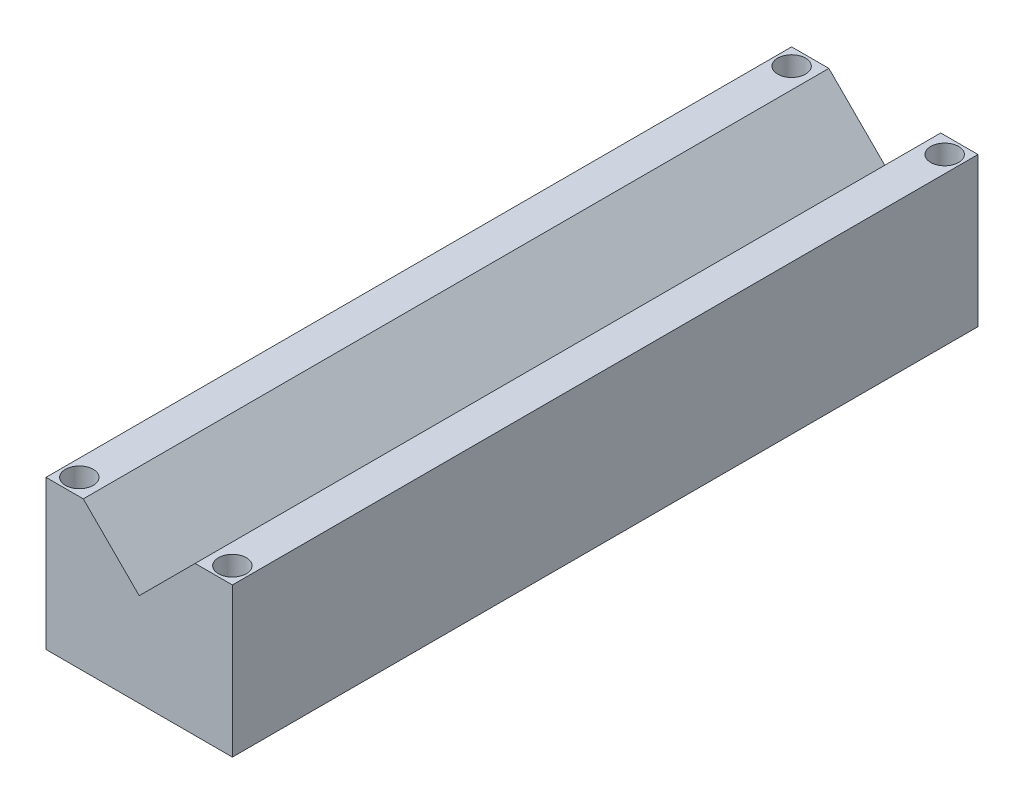
ISO-10303-21;
HEADER;
FILE_DESCRIPTION(('STEP AP214'),'2;1');
FILE_NAME('part.step','',(''),(''),'','','');
FILE_SCHEMA(('AUTOMOTIVE_DESIGN { 1 0 10303 214 1 1 1 1 }'));
ENDSEC;
DATA;
#1=APPLICATION_CONTEXT('core data for automotive mechanical design processes');
#2=APPLICATION_PROTOCOL_DEFINITION('international standard','automotive_design',2000,#1);
#3=PRODUCT_CONTEXT('',#1,'mechanical');
#4=PRODUCT('Part','Part','',(#3));
#5=PRODUCT_RELATED_PRODUCT_CATEGORY('part','',(#4));
#6=PRODUCT_DEFINITION_FORMATION('','',#4);
#7=PRODUCT_DEFINITION_CONTEXT('part definition',#1,'design');
#8=PRODUCT_DEFINITION('design','',#6,#7);
#9=PRODUCT_DEFINITION_SHAPE('','',#8);
#10=(LENGTH_UNIT() NAMED_UNIT(*) SI_UNIT(.MILLI.,.METRE.));
#11=(NAMED_UNIT(*) PLANE_ANGLE_UNIT() SI_UNIT($,.RADIAN.));
#12=(NAMED_UNIT(*) SI_UNIT($,.STERADIAN.) SOLID_ANGLE_UNIT());
#13=UNCERTAINTY_MEASURE_WITH_UNIT(LENGTH_MEASURE(1.E-05),#10,'distance_accuracy_value','');
#14=(GEOMETRIC_REPRESENTATION_CONTEXT(3) GLOBAL_UNCERTAINTY_ASSIGNED_CONTEXT((#13)) GLOBAL_UNIT_ASSIGNED_CONTEXT((#10,
#11,#12)) REPRESENTATION_CONTEXT('',''));
#15=CARTESIAN_POINT('',(0.,0.,0.));
#16=DIRECTION('',(0.,0.,1.));
#17=DIRECTION('',(1.,0.,0.));
#18=AXIS2_PLACEMENT_3D('',#15,#16,#17);
#19=CARTESIAN_POINT('',(5.68,-8.98025612106916,-248.325));
#20=DIRECTION('',(0.,1.,0.));
#21=DIRECTION('',(0.,0.,1.));
#22=AXIS2_PLACEMENT_3D('',#19,#20,#21);
#23=CYLINDRICAL_SURFACE('',#22,3.175);
#24=CARTESIAN_POINT('',(5.68,0.,-248.325));
#25=DIRECTION('',(0.,-1.,0.));
#26=DIRECTION('',(0.,0.,-1.));
#27=AXIS2_PLACEMENT_3D('',#24,#25,#26);
#28=CIRCLE('',#27,3.175);
#29=CARTESIAN_POINT('',(5.68,0.,-251.5));
#30=VERTEX_POINT('',#29);
#31=EDGE_CURVE('E195',#30,#30,#28,.F.);
#32=ORIENTED_EDGE('',*,*,#31,.F.);
#33=EDGE_LOOP('',(#32));
#34=FACE_BOUND('',#33,.T.);
#35=CARTESIAN_POINT('',(5.68,42.8,-248.325));
#36=DIRECTION('',(0.,1.,0.));
#37=DIRECTION('',(0.,0.,1.));
#38=AXIS2_PLACEMENT_3D('',#35,#36,#37);
#39=CIRCLE('',#38,3.175);
#40=CARTESIAN_POINT('',(5.68,42.8,-245.15));
#41=VERTEX_POINT('',#40);
#42=EDGE_CURVE('E41',#41,#41,#39,.F.);
#43=ORIENTED_EDGE('',*,*,#42,.F.);
#44=EDGE_LOOP('',(#43));
#45=FACE_BOUND('',#44,.T.);
#46=ADVANCED_FACE('F37',(#34,#45),#23,.F.);
#47=CARTESIAN_POINT('',(57.82,-8.98025612106916,-248.325));
#48=DIRECTION('',(0.,1.,0.));
#49=DIRECTION('',(0.,0.,1.));
#50=AXIS2_PLACEMENT_3D('',#47,#48,#49);
#51=CYLINDRICAL_SURFACE('',#50,3.175);
#52=CARTESIAN_POINT('',(57.82,0.,-248.325));
#53=DIRECTION('',(0.,-1.,0.));
#54=DIRECTION('',(0.,0.,-1.));
#55=AXIS2_PLACEMENT_3D('',#52,#53,#54);
#56=CIRCLE('',#55,3.175);
#57=CARTESIAN_POINT('',(57.82,0.,-251.5));
#58=VERTEX_POINT('',#57);
#59=EDGE_CURVE('E154',#58,#58,#56,.F.);
#60=ORIENTED_EDGE('',*,*,#59,.F.);
#61=EDGE_LOOP('',(#60));
#62=FACE_BOUND('',#61,.T.);
#63=CARTESIAN_POINT('',(57.82,42.8,-248.325));
#64=DIRECTION('',(0.,1.,0.));
#65=DIRECTION('',(0.,0.,1.));
#66=AXIS2_PLACEMENT_3D('',#63,#64,#65);
#67=CIRCLE('',#66,3.175);
#68=CARTESIAN_POINT('',(57.82,42.8,-245.15));
#69=VERTEX_POINT('',#68);
#70=EDGE_CURVE('E160',#69,#69,#67,.F.);
#71=ORIENTED_EDGE('',*,*,#70,.F.);
#72=EDGE_LOOP('',(#71));
#73=FACE_BOUND('',#72,.T.);
#74=ADVANCED_FACE('F234',(#62,#73),#51,.F.);
#75=CARTESIAN_POINT('',(0.,50.8,-254.));
#76=DIRECTION('',(0.,1.,0.));
#77=DIRECTION('',(0.,0.,1.));
#78=AXIS2_PLACEMENT_3D('',#75,#76,#77);
#79=PLANE('',#78);
#80=CARTESIAN_POINT('',(57.82,50.8,-248.325));
#81=DIRECTION('',(0.,1.,0.));
#82=DIRECTION('',(0.,0.,1.));
#83=AXIS2_PLACEMENT_3D('',#80,#81,#82);
#84=CIRCLE('',#83,4.75);
#85=CARTESIAN_POINT('',(57.82,50.8,-243.575));
#86=VERTEX_POINT('',#85);
#87=EDGE_CURVE('E168',#86,#86,#84,.T.);
#88=ORIENTED_EDGE('',*,*,#87,.F.);
#89=EDGE_LOOP('',(#88));
#90=FACE_BOUND('',#89,.T.);
#91=DIRECTION('',(0.,0.,1.));
#92=VECTOR('',#91,1.);
#93=CARTESIAN_POINT('',(50.7999999999998,50.8,-296.597094971371));
#94=LINE('',#93,#92);
#95=CARTESIAN_POINT('',(50.7999999999998,50.8,-254.));
#96=VERTEX_POINT('',#95);
#97=CARTESIAN_POINT('',(50.7999999999998,50.8,0.));
#98=VERTEX_POINT('',#97);
#99=EDGE_CURVE('E107',#96,#98,#94,.T.);
#100=ORIENTED_EDGE('',*,*,#99,.T.);
#101=DIRECTION('',(-1.,0.,0.));
#102=VECTOR('',#101,1.);
#103=CARTESIAN_POINT('',(0.,50.8,0.));
#104=LINE('',#103,#102);
#105=CARTESIAN_POINT('',(63.5,50.8,0.));
#106=VERTEX_POINT('',#105);
#107=EDGE_CURVE('E146',#106,#98,#104,.T.);
#108=ORIENTED_EDGE('',*,*,#107,.F.);
#109=DIRECTION('',(0.,0.,1.));
#110=VECTOR('',#109,1.);
#111=CARTESIAN_POINT('',(63.5,50.8,-254.));
#112=LINE('',#111,#110);
#113=CARTESIAN_POINT('',(63.5,50.8,-254.));
#114=VERTEX_POINT('',#113);
#115=EDGE_CURVE('E46',#114,#106,#112,.T.);
#116=ORIENTED_EDGE('',*,*,#115,.F.);
#117=DIRECTION('',(-1.,0.,0.));
#118=VECTOR('',#117,1.);
#119=CARTESIAN_POINT('',(0.,50.8,-254.));
#120=LINE('',#119,#118);
#121=EDGE_CURVE('E124',#114,#96,#120,.T.);
#122=ORIENTED_EDGE('',*,*,#121,.T.);
#123=EDGE_LOOP('',(#100,#108,#116,#122));
#124=FACE_BOUND('',#123,.T.);
#125=CARTESIAN_POINT('',(57.82,50.8,-5.675));
#126=DIRECTION('',(0.,1.,0.));
#127=DIRECTION('',(0.,0.,1.));
#128=AXIS2_PLACEMENT_3D('',#125,#126,#127);
#129=CIRCLE('',#128,4.75);
#130=CARTESIAN_POINT('',(57.82,50.8,-0.925000000000001));
#131=VERTEX_POINT('',#130);
#132=EDGE_CURVE('E158',#131,#131,#129,.T.);
#133=ORIENTED_EDGE('',*,*,#132,.F.);
#134=EDGE_LOOP('',(#133));
#135=FACE_BOUND('',#134,.T.);
#136=ADVANCED_FACE('F127',(#90,#124,#135),#79,.T.);
#137=CARTESIAN_POINT('',(5.68,-8.98025612106916,-5.675));
#138=DIRECTION('',(0.,1.,0.));
#139=DIRECTION('',(0.,0.,1.));
#140=AXIS2_PLACEMENT_3D('',#137,#138,#139);
#141=CYLINDRICAL_SURFACE('',#140,3.175);
#142=CARTESIAN_POINT('',(5.68,0.,-5.675));
#143=DIRECTION('',(0.,-1.,0.));
#144=DIRECTION('',(0.,0.,-1.));
#145=AXIS2_PLACEMENT_3D('',#142,#143,#144);
#146=CIRCLE('',#145,3.175);
#147=CARTESIAN_POINT('',(5.68,0.,-8.85));
#148=VERTEX_POINT('',#147);
#149=EDGE_CURVE('E192',#148,#148,#146,.F.);
#150=ORIENTED_EDGE('',*,*,#149,.F.);
#151=EDGE_LOOP('',(#150));
#152=FACE_BOUND('',#151,.T.);
#153=CARTESIAN_POINT('',(5.68,42.8,-5.675));
#154=DIRECTION('',(0.,1.,0.));
#155=DIRECTION('',(0.,0.,1.));
#156=AXIS2_PLACEMENT_3D('',#153,#154,#155);
#157=CIRCLE('',#156,3.175);
#158=CARTESIAN_POINT('',(5.68,42.8,-2.5));
#159=VERTEX_POINT('',#158);
#160=EDGE_CURVE('E156',#159,#159,#157,.F.);
#161=ORIENTED_EDGE('',*,*,#160,.F.);
#162=EDGE_LOOP('',(#161));
#163=FACE_BOUND('',#162,.T.);
#164=ADVANCED_FACE('F245',(#152,#163),#141,.F.);
#165=CARTESIAN_POINT('',(57.82,-8.98025612106916,-5.675));
#166=DIRECTION('',(0.,1.,0.));
#167=DIRECTION('',(0.,0.,1.));
#168=AXIS2_PLACEMENT_3D('',#165,#166,#167);
#169=CYLINDRICAL_SURFACE('',#168,3.175);
#170=CARTESIAN_POINT('',(57.82,0.,-5.675));
#171=DIRECTION('',(0.,-1.,0.));
#172=DIRECTION('',(0.,0.,-1.));
#173=AXIS2_PLACEMENT_3D('',#170,#171,#172);
#174=CIRCLE('',#173,3.175);
#175=CARTESIAN_POINT('',(57.82,0.,-8.85));
#176=VERTEX_POINT('',#175);
#177=EDGE_CURVE('E140',#176,#176,#174,.F.);
#178=ORIENTED_EDGE('',*,*,#177,.F.);
#179=EDGE_LOOP('',(#178));
#180=FACE_BOUND('',#179,.T.);
#181=CARTESIAN_POINT('',(57.82,42.8,-5.675));
#182=DIRECTION('',(0.,1.,0.));
#183=DIRECTION('',(0.,0.,1.));
#184=AXIS2_PLACEMENT_3D('',#181,#182,#183);
#185=CIRCLE('',#184,3.175);
#186=CARTESIAN_POINT('',(57.82,42.8,-2.5));
#187=VERTEX_POINT('',#186);
#188=EDGE_CURVE('E151',#187,#187,#185,.F.);
#189=ORIENTED_EDGE('',*,*,#188,.F.);
#190=EDGE_LOOP('',(#189));
#191=FACE_BOUND('',#190,.T.);
#192=ADVANCED_FACE('F248',(#180,#191),#169,.F.);
#193=CARTESIAN_POINT('',(0.,0.,-254.));
#194=DIRECTION('',(-1.,0.,0.));
#195=DIRECTION('',(0.,0.,1.));
#196=AXIS2_PLACEMENT_3D('',#193,#194,#195);
#197=PLANE('',#196);
#198=DIRECTION('',(0.,-1.,0.));
#199=VECTOR('',#198,1.);
#200=CARTESIAN_POINT('',(0.,0.,0.));
#201=LINE('',#200,#199);
#202=CARTESIAN_POINT('',(0.,50.8,0.));
#203=VERTEX_POINT('',#202);
#204=CARTESIAN_POINT('',(0.,0.,0.));
#205=VERTEX_POINT('',#204);
#206=EDGE_CURVE('E137',#203,#205,#201,.T.);
#207=ORIENTED_EDGE('',*,*,#206,.F.);
#208=DIRECTION('',(0.,0.,1.));
#209=VECTOR('',#208,1.);
#210=CARTESIAN_POINT('',(0.,50.8,-254.));
#211=LINE('',#210,#209);
#212=CARTESIAN_POINT('',(0.,50.8,-254.));
#213=VERTEX_POINT('',#212);
#214=EDGE_CURVE('E11',#213,#203,#211,.T.);
#215=ORIENTED_EDGE('',*,*,#214,.F.);
#216=DIRECTION('',(0.,-1.,0.));
#217=VECTOR('',#216,1.);
#218=CARTESIAN_POINT('',(0.,0.,-254.));
#219=LINE('',#218,#217);
#220=CARTESIAN_POINT('',(0.,0.,-254.));
#221=VERTEX_POINT('',#220);
#222=EDGE_CURVE('E147',#213,#221,#219,.T.);
#223=ORIENTED_EDGE('',*,*,#222,.T.);
#224=DIRECTION('',(0.,0.,1.));
#225=VECTOR('',#224,1.);
#226=CARTESIAN_POINT('',(0.,0.,-254.));
#227=LINE('',#226,#225);
#228=EDGE_CURVE('E89',#221,#205,#227,.T.);
#229=ORIENTED_EDGE('',*,*,#228,.T.);
#230=EDGE_LOOP('',(#207,#215,#223,#229));
#231=FACE_BOUND('',#230,.T.);
#232=ADVANCED_FACE('F39',(#231),#197,.T.);
#233=CARTESIAN_POINT('',(5.68,50.8,-248.325));
#234=DIRECTION('',(0.,1.,0.));
#235=DIRECTION('',(0.,0.,1.));
#236=AXIS2_PLACEMENT_3D('',#233,#234,#235);
#237=CIRCLE('',#236,4.75);
#238=CARTESIAN_POINT('',(5.68,50.8,-243.575));
#239=VERTEX_POINT('',#238);
#240=EDGE_CURVE('E175',#239,#239,#237,.T.);
#241=ORIENTED_EDGE('',*,*,#240,.F.);
#242=EDGE_LOOP('',(#241));
#243=FACE_BOUND('',#242,.T.);
#244=DIRECTION('',(0.,0.,1.));
#245=VECTOR('',#244,1.);
#246=CARTESIAN_POINT('',(12.7000000000002,50.8,-296.597094971371));
#247=LINE('',#246,#245);
#248=CARTESIAN_POINT('',(12.7000000000002,50.8,-254.));
#249=VERTEX_POINT('',#248);
#250=CARTESIAN_POINT('',(12.7000000000002,50.8,0.));
#251=VERTEX_POINT('',#250);
#252=EDGE_CURVE('E54',#249,#251,#247,.T.);
#253=ORIENTED_EDGE('',*,*,#252,.F.);
#254=EDGE_CURVE('E61',#249,#213,#120,.T.);
#255=ORIENTED_EDGE('',*,*,#254,.T.);
#256=ORIENTED_EDGE('',*,*,#214,.T.);
#257=EDGE_CURVE('E83',#251,#203,#104,.T.);
#258=ORIENTED_EDGE('',*,*,#257,.F.);
#259=EDGE_LOOP('',(#253,#255,#256,#258));
#260=FACE_BOUND('',#259,.T.);
#261=CARTESIAN_POINT('',(5.68,50.8,-5.675));
#262=DIRECTION('',(0.,1.,0.));
#263=DIRECTION('',(0.,0.,1.));
#264=AXIS2_PLACEMENT_3D('',#261,#262,#263);
#265=CIRCLE('',#264,4.75);
#266=CARTESIAN_POINT('',(5.68,50.8,-0.924999999999999));
#267=VERTEX_POINT('',#266);
#268=EDGE_CURVE('E183',#267,#267,#265,.T.);
#269=ORIENTED_EDGE('',*,*,#268,.F.);
#270=EDGE_LOOP('',(#269));
#271=FACE_BOUND('',#270,.T.);
#272=ADVANCED_FACE('F210',(#243,#260,#271),#79,.T.);
#273=CARTESIAN_POINT('',(63.5,0.,-254.));
#274=DIRECTION('',(1.,0.,0.));
#275=DIRECTION('',(0.,0.,-1.));
#276=AXIS2_PLACEMENT_3D('',#273,#274,#275);
#277=PLANE('',#276);
#278=DIRECTION('',(0.,1.,0.));
#279=VECTOR('',#278,1.);
#280=CARTESIAN_POINT('',(63.5,0.,0.));
#281=LINE('',#280,#279);
#282=CARTESIAN_POINT('',(63.5,0.,0.));
#283=VERTEX_POINT('',#282);
#284=EDGE_CURVE('E143',#283,#106,#281,.T.);
#285=ORIENTED_EDGE('',*,*,#284,.F.);
#286=DIRECTION('',(0.,0.,1.));
#287=VECTOR('',#286,1.);
#288=CARTESIAN_POINT('',(63.5,0.,-254.));
#289=LINE('',#288,#287);
#290=CARTESIAN_POINT('',(63.5,0.,-254.));
#291=VERTEX_POINT('',#290);
#292=EDGE_CURVE('E131',#291,#283,#289,.T.);
#293=ORIENTED_EDGE('',*,*,#292,.F.);
#294=DIRECTION('',(0.,1.,0.));
#295=VECTOR('',#294,1.);
#296=CARTESIAN_POINT('',(63.5,0.,-254.));
#297=LINE('',#296,#295);
#298=EDGE_CURVE('E133',#291,#114,#297,.T.);
#299=ORIENTED_EDGE('',*,*,#298,.T.);
#300=ORIENTED_EDGE('',*,*,#115,.T.);
#301=EDGE_LOOP('',(#285,#293,#299,#300));
#302=FACE_BOUND('',#301,.T.);
#303=ADVANCED_FACE('F206',(#302),#277,.T.);
#304=CARTESIAN_POINT('',(0.,0.,-254.));
#305=DIRECTION('',(0.,-1.,0.));
#306=DIRECTION('',(0.,0.,-1.));
#307=AXIS2_PLACEMENT_3D('',#304,#305,#306);
#308=PLANE('',#307);
#309=ORIENTED_EDGE('',*,*,#149,.T.);
#310=EDGE_LOOP('',(#309));
#311=FACE_BOUND('',#310,.T.);
#312=ORIENTED_EDGE('',*,*,#31,.T.);
#313=EDGE_LOOP('',(#312));
#314=FACE_BOUND('',#313,.T.);
#315=ORIENTED_EDGE('',*,*,#59,.T.);
#316=EDGE_LOOP('',(#315));
#317=FACE_BOUND('',#316,.T.);
#318=ORIENTED_EDGE('',*,*,#177,.T.);
#319=EDGE_LOOP('',(#318));
#320=FACE_BOUND('',#319,.T.);
#321=DIRECTION('',(1.,0.,0.));
#322=VECTOR('',#321,1.);
#323=CARTESIAN_POINT('',(0.,0.,0.));
#324=LINE('',#323,#322);
#325=EDGE_CURVE('E139',#205,#283,#324,.T.);
#326=ORIENTED_EDGE('',*,*,#325,.F.);
#327=ORIENTED_EDGE('',*,*,#228,.F.);
#328=DIRECTION('',(1.,0.,0.));
#329=VECTOR('',#328,1.);
#330=CARTESIAN_POINT('',(0.,0.,-254.));
#331=LINE('',#330,#329);
#332=EDGE_CURVE('E203',#221,#291,#331,.T.);
#333=ORIENTED_EDGE('',*,*,#332,.T.);
#334=ORIENTED_EDGE('',*,*,#292,.T.);
#335=EDGE_LOOP('',(#326,#327,#333,#334));
#336=FACE_BOUND('',#335,.T.);
#337=ADVANCED_FACE('F255',(#311,#314,#317,#320,#336),#308,.T.);
#338=CARTESIAN_POINT('',(0.,0.,-254.));
#339=DIRECTION('',(0.,0.,-1.));
#340=DIRECTION('',(-1.,0.,0.));
#341=AXIS2_PLACEMENT_3D('',#338,#339,#340);
#342=PLANE('',#341);
#343=DIRECTION('',(0.707106781186543,0.707106781186552,0.));
#344=VECTOR('',#343,1.);
#345=CARTESIAN_POINT('',(31.75,31.75,-254.));
#346=LINE('',#345,#344);
#347=CARTESIAN_POINT('',(31.75,31.75,-254.));
#348=VERTEX_POINT('',#347);
#349=EDGE_CURVE('E110',#348,#96,#346,.T.);
#350=ORIENTED_EDGE('',*,*,#349,.T.);
#351=ORIENTED_EDGE('',*,*,#121,.F.);
#352=ORIENTED_EDGE('',*,*,#298,.F.);
#353=ORIENTED_EDGE('',*,*,#332,.F.);
#354=ORIENTED_EDGE('',*,*,#222,.F.);
#355=ORIENTED_EDGE('',*,*,#254,.F.);
#356=DIRECTION('',(0.707106781186544,-0.707106781186551,0.));
#357=VECTOR('',#356,1.);
#358=CARTESIAN_POINT('',(31.75,31.75,-254.));
#359=LINE('',#358,#357);
#360=EDGE_CURVE('E125',#249,#348,#359,.T.);
#361=ORIENTED_EDGE('',*,*,#360,.T.);
#362=EDGE_LOOP('',(#350,#351,#352,#353,#354,#355,#361));
#363=FACE_BOUND('',#362,.T.);
#364=ADVANCED_FACE('F122',(#363),#342,.T.);
#365=CARTESIAN_POINT('',(0.,0.,0.));
#366=DIRECTION('',(0.,0.,-1.));
#367=DIRECTION('',(-1.,0.,0.));
#368=AXIS2_PLACEMENT_3D('',#365,#366,#367);
#369=PLANE('',#368);
#370=ORIENTED_EDGE('',*,*,#107,.T.);
#371=DIRECTION('',(0.707106781186543,0.707106781186552,0.));
#372=VECTOR('',#371,1.);
#373=CARTESIAN_POINT('',(31.75,31.75,0.));
#374=LINE('',#373,#372);
#375=CARTESIAN_POINT('',(31.75,31.75,0.));
#376=VERTEX_POINT('',#375);
#377=EDGE_CURVE('E113',#376,#98,#374,.T.);
#378=ORIENTED_EDGE('',*,*,#377,.F.);
#379=DIRECTION('',(0.707106781186544,-0.707106781186552,0.));
#380=VECTOR('',#379,1.);
#381=CARTESIAN_POINT('',(31.75,31.75,0.));
#382=LINE('',#381,#380);
#383=EDGE_CURVE('E162',#251,#376,#382,.T.);
#384=ORIENTED_EDGE('',*,*,#383,.F.);
#385=ORIENTED_EDGE('',*,*,#257,.T.);
#386=ORIENTED_EDGE('',*,*,#206,.T.);
#387=ORIENTED_EDGE('',*,*,#325,.T.);
#388=ORIENTED_EDGE('',*,*,#284,.T.);
#389=EDGE_LOOP('',(#370,#378,#384,#385,#386,#387,#388));
#390=FACE_BOUND('',#389,.T.);
#391=ADVANCED_FACE('F254',(#390),#369,.F.);
#392=CARTESIAN_POINT('',(57.82,42.8,-5.675));
#393=DIRECTION('',(0.,1.,0.));
#394=DIRECTION('',(0.,0.,1.));
#395=AXIS2_PLACEMENT_3D('',#392,#393,#394);
#396=PLANE('',#395);
#397=CARTESIAN_POINT('',(57.82,42.8,-5.675));
#398=DIRECTION('',(0.,1.,0.));
#399=DIRECTION('',(0.,0.,1.));
#400=AXIS2_PLACEMENT_3D('',#397,#398,#399);
#401=CIRCLE('',#400,4.75);
#402=CARTESIAN_POINT('',(57.82,42.8,-0.925000000000001));
#403=VERTEX_POINT('',#402);
#404=EDGE_CURVE('E155',#403,#403,#401,.T.);
#405=ORIENTED_EDGE('',*,*,#404,.T.);
#406=EDGE_LOOP('',(#405));
#407=FACE_BOUND('',#406,.T.);
#408=ORIENTED_EDGE('',*,*,#188,.T.);
#409=EDGE_LOOP('',(#408));
#410=FACE_BOUND('',#409,.T.);
#411=ADVANCED_FACE('F257',(#407,#410),#396,.T.);
#412=CARTESIAN_POINT('',(57.82,42.8,-5.675));
#413=DIRECTION('',(0.,1.,0.));
#414=DIRECTION('',(0.,0.,1.));
#415=AXIS2_PLACEMENT_3D('',#412,#413,#414);
#416=CYLINDRICAL_SURFACE('',#415,4.75);
#417=ORIENTED_EDGE('',*,*,#404,.F.);
#418=EDGE_LOOP('',(#417));
#419=FACE_BOUND('',#418,.T.);
#420=ORIENTED_EDGE('',*,*,#132,.T.);
#421=EDGE_LOOP('',(#420));
#422=FACE_BOUND('',#421,.T.);
#423=ADVANCED_FACE('F228',(#419,#422),#416,.F.);
#424=CARTESIAN_POINT('',(5.68,42.8,-5.675));
#425=DIRECTION('',(0.,1.,0.));
#426=DIRECTION('',(0.,0.,1.));
#427=AXIS2_PLACEMENT_3D('',#424,#425,#426);
#428=PLANE('',#427);
#429=CARTESIAN_POINT('',(5.68,42.8,-5.675));
#430=DIRECTION('',(0.,1.,0.));
#431=DIRECTION('',(0.,0.,1.));
#432=AXIS2_PLACEMENT_3D('',#429,#430,#431);
#433=CIRCLE('',#432,4.75);
#434=CARTESIAN_POINT('',(5.68,42.8,-0.924999999999999));
#435=VERTEX_POINT('',#434);
#436=EDGE_CURVE('E159',#435,#435,#433,.T.);
#437=ORIENTED_EDGE('',*,*,#436,.T.);
#438=EDGE_LOOP('',(#437));
#439=FACE_BOUND('',#438,.T.);
#440=ORIENTED_EDGE('',*,*,#160,.T.);
#441=EDGE_LOOP('',(#440));
#442=FACE_BOUND('',#441,.T.);
#443=ADVANCED_FACE('F219',(#439,#442),#428,.T.);
#444=CARTESIAN_POINT('',(5.68,42.8,-5.675));
#445=DIRECTION('',(0.,1.,0.));
#446=DIRECTION('',(0.,0.,1.));
#447=AXIS2_PLACEMENT_3D('',#444,#445,#446);
#448=CYLINDRICAL_SURFACE('',#447,4.75);
#449=ORIENTED_EDGE('',*,*,#436,.F.);
#450=EDGE_LOOP('',(#449));
#451=FACE_BOUND('',#450,.T.);
#452=ORIENTED_EDGE('',*,*,#268,.T.);
#453=EDGE_LOOP('',(#452));
#454=FACE_BOUND('',#453,.T.);
#455=ADVANCED_FACE('F217',(#451,#454),#448,.F.);
#456=CARTESIAN_POINT('',(31.75,31.75,-296.597094971371));
#457=DIRECTION('',(0.707106781186552,-0.707106781186543,0.));
#458=DIRECTION('',(0.707106781186543,0.707106781186552,0.));
#459=AXIS2_PLACEMENT_3D('',#456,#457,#458);
#460=PLANE('',#459);
#461=DIRECTION('',(0.,0.,1.));
#462=VECTOR('',#461,1.);
#463=CARTESIAN_POINT('',(31.75,31.75,-296.597094971371));
#464=LINE('',#463,#462);
#465=EDGE_CURVE('E180',#348,#376,#464,.T.);
#466=ORIENTED_EDGE('',*,*,#465,.T.);
#467=ORIENTED_EDGE('',*,*,#377,.T.);
#468=ORIENTED_EDGE('',*,*,#99,.F.);
#469=ORIENTED_EDGE('',*,*,#349,.F.);
#470=EDGE_LOOP('',(#466,#467,#468,#469));
#471=FACE_BOUND('',#470,.T.);
#472=ADVANCED_FACE('F109',(#471),#460,.F.);
#473=CARTESIAN_POINT('',(31.75,31.75,-296.597094971371));
#474=DIRECTION('',(-0.707106781186552,-0.707106781186544,0.));
#475=DIRECTION('',(0.707106781186544,-0.707106781186551,0.));
#476=AXIS2_PLACEMENT_3D('',#473,#474,#475);
#477=PLANE('',#476);
#478=ORIENTED_EDGE('',*,*,#252,.T.);
#479=ORIENTED_EDGE('',*,*,#383,.T.);
#480=ORIENTED_EDGE('',*,*,#465,.F.);
#481=ORIENTED_EDGE('',*,*,#360,.F.);
#482=EDGE_LOOP('',(#478,#479,#480,#481));
#483=FACE_BOUND('',#482,.T.);
#484=ADVANCED_FACE('F226',(#483),#477,.F.);
#485=CARTESIAN_POINT('',(57.82,42.8,-248.325));
#486=DIRECTION('',(0.,1.,0.));
#487=DIRECTION('',(0.,0.,1.));
#488=AXIS2_PLACEMENT_3D('',#485,#486,#487);
#489=PLANE('',#488);
#490=CARTESIAN_POINT('',(57.82,42.8,-248.325));
#491=DIRECTION('',(0.,1.,0.));
#492=DIRECTION('',(0.,0.,1.));
#493=AXIS2_PLACEMENT_3D('',#490,#491,#492);
#494=CIRCLE('',#493,4.75);
#495=CARTESIAN_POINT('',(57.82,42.8,-243.575));
#496=VERTEX_POINT('',#495);
#497=EDGE_CURVE('E163',#496,#496,#494,.T.);
#498=ORIENTED_EDGE('',*,*,#497,.T.);
#499=EDGE_LOOP('',(#498));
#500=FACE_BOUND('',#499,.T.);
#501=ORIENTED_EDGE('',*,*,#70,.T.);
#502=EDGE_LOOP('',(#501));
#503=FACE_BOUND('',#502,.T.);
#504=ADVANCED_FACE('F271',(#500,#503),#489,.T.);
#505=CARTESIAN_POINT('',(57.82,42.8,-248.325));
#506=DIRECTION('',(0.,1.,0.));
#507=DIRECTION('',(0.,0.,1.));
#508=AXIS2_PLACEMENT_3D('',#505,#506,#507);
#509=CYLINDRICAL_SURFACE('',#508,4.75);
#510=ORIENTED_EDGE('',*,*,#497,.F.);
#511=EDGE_LOOP('',(#510));
#512=FACE_BOUND('',#511,.T.);
#513=ORIENTED_EDGE('',*,*,#87,.T.);
#514=EDGE_LOOP('',(#513));
#515=FACE_BOUND('',#514,.T.);
#516=ADVANCED_FACE('F276',(#512,#515),#509,.F.);
#517=CARTESIAN_POINT('',(5.68,42.8,-248.325));
#518=DIRECTION('',(0.,1.,0.));
#519=DIRECTION('',(0.,0.,1.));
#520=AXIS2_PLACEMENT_3D('',#517,#518,#519);
#521=PLANE('',#520);
#522=CARTESIAN_POINT('',(5.68,42.8,-248.325));
#523=DIRECTION('',(0.,1.,0.));
#524=DIRECTION('',(0.,0.,1.));
#525=AXIS2_PLACEMENT_3D('',#522,#523,#524);
#526=CIRCLE('',#525,4.75);
#527=CARTESIAN_POINT('',(5.68,42.8,-243.575));
#528=VERTEX_POINT('',#527);
#529=EDGE_CURVE('E294',#528,#528,#526,.T.);
#530=ORIENTED_EDGE('',*,*,#529,.T.);
#531=EDGE_LOOP('',(#530));
#532=FACE_BOUND('',#531,.T.);
#533=ORIENTED_EDGE('',*,*,#42,.T.);
#534=EDGE_LOOP('',(#533));
#535=FACE_BOUND('',#534,.T.);
#536=ADVANCED_FACE('F280',(#532,#535),#521,.T.);
#537=CARTESIAN_POINT('',(5.68,42.8,-248.325));
#538=DIRECTION('',(0.,1.,0.));
#539=DIRECTION('',(0.,0.,1.));
#540=AXIS2_PLACEMENT_3D('',#537,#538,#539);
#541=CYLINDRICAL_SURFACE('',#540,4.75);
#542=ORIENTED_EDGE('',*,*,#529,.F.);
#543=EDGE_LOOP('',(#542));
#544=FACE_BOUND('',#543,.T.);
#545=ORIENTED_EDGE('',*,*,#240,.T.);
#546=EDGE_LOOP('',(#545));
#547=FACE_BOUND('',#546,.T.);
#548=ADVANCED_FACE('F283',(#544,#547),#541,.F.);
#549=CLOSED_SHELL('',(#46,#74,#136,#164,#192,#232,#272,#303,#337,#364,#391,#411,#423,#443,#455,
#472,#484,#504,#516,#536,#548));
#550=MANIFOLD_SOLID_BREP('B2',#549);
#551=ADVANCED_BREP_SHAPE_REPRESENTATION('',(#18,#550),#14);
#552=SHAPE_DEFINITION_REPRESENTATION(#9,#551);
ENDSEC;
END-ISO-10303-21;
